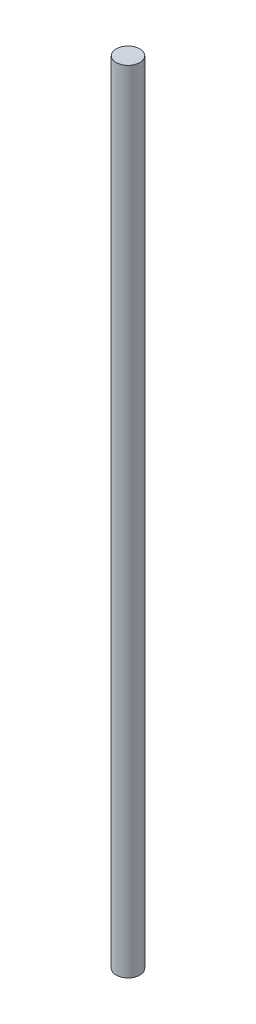
ISO-10303-21;
HEADER;
FILE_DESCRIPTION(('STEP AP214'),'2;1');
FILE_NAME('part.step','',(''),(''),'','','');
FILE_SCHEMA(('AUTOMOTIVE_DESIGN { 1 0 10303 214 1 1 1 1 }'));
ENDSEC;
DATA;
#1=APPLICATION_CONTEXT('core data for automotive mechanical design processes');
#2=APPLICATION_PROTOCOL_DEFINITION('international standard','automotive_design',2000,#1);
#3=PRODUCT_CONTEXT('',#1,'mechanical');
#4=PRODUCT('Part','Part','',(#3));
#5=PRODUCT_RELATED_PRODUCT_CATEGORY('part','',(#4));
#6=PRODUCT_DEFINITION_FORMATION('','',#4);
#7=PRODUCT_DEFINITION_CONTEXT('part definition',#1,'design');
#8=PRODUCT_DEFINITION('design','',#6,#7);
#9=PRODUCT_DEFINITION_SHAPE('','',#8);
#10=(LENGTH_UNIT() NAMED_UNIT(*) SI_UNIT(.MILLI.,.METRE.));
#11=(NAMED_UNIT(*) PLANE_ANGLE_UNIT() SI_UNIT($,.RADIAN.));
#12=(NAMED_UNIT(*) SI_UNIT($,.STERADIAN.) SOLID_ANGLE_UNIT());
#13=UNCERTAINTY_MEASURE_WITH_UNIT(LENGTH_MEASURE(1.E-05),#10,'distance_accuracy_value','');
#14=(GEOMETRIC_REPRESENTATION_CONTEXT(3) GLOBAL_UNCERTAINTY_ASSIGNED_CONTEXT((#13)) GLOBAL_UNIT_ASSIGNED_CONTEXT((#10,
#11,#12)) REPRESENTATION_CONTEXT('',''));
#15=CARTESIAN_POINT('',(0.,0.,0.));
#16=DIRECTION('',(0.,0.,1.));
#17=DIRECTION('',(1.,0.,0.));
#18=AXIS2_PLACEMENT_3D('',#15,#16,#17);
#19=CARTESIAN_POINT('',(0.,200.,0.));
#20=DIRECTION('',(0.,-1.,0.));
#21=DIRECTION('',(0.,0.,-1.));
#22=AXIS2_PLACEMENT_3D('',#19,#20,#21);
#23=CYLINDRICAL_SURFACE('',#22,3.);
#24=CARTESIAN_POINT('',(0.,200.,0.));
#25=DIRECTION('',(0.,1.,0.));
#26=DIRECTION('',(0.,0.,1.));
#27=AXIS2_PLACEMENT_3D('',#24,#25,#26);
#28=CIRCLE('',#27,3.);
#29=CARTESIAN_POINT('',(0.,200.,3.));
#30=VERTEX_POINT('',#29);
#31=EDGE_CURVE('E10',#30,#30,#28,.T.);
#32=ORIENTED_EDGE('',*,*,#31,.F.);
#33=EDGE_LOOP('',(#32));
#34=FACE_BOUND('',#33,.T.);
#35=CARTESIAN_POINT('',(0.,0.,0.));
#36=DIRECTION('',(0.,1.,0.));
#37=DIRECTION('',(0.,0.,1.));
#38=AXIS2_PLACEMENT_3D('',#35,#36,#37);
#39=CIRCLE('',#38,3.);
#40=CARTESIAN_POINT('',(0.,0.,3.));
#41=VERTEX_POINT('',#40);
#42=EDGE_CURVE('E35',#41,#41,#39,.T.);
#43=ORIENTED_EDGE('',*,*,#42,.T.);
#44=EDGE_LOOP('',(#43));
#45=FACE_BOUND('',#44,.T.);
#46=ADVANCED_FACE('F32',(#34,#45),#23,.T.);
#47=CARTESIAN_POINT('',(0.,200.,0.));
#48=DIRECTION('',(0.,1.,0.));
#49=DIRECTION('',(0.,0.,1.));
#50=AXIS2_PLACEMENT_3D('',#47,#48,#49);
#51=PLANE('',#50);
#52=ORIENTED_EDGE('',*,*,#31,.T.);
#53=EDGE_LOOP('',(#52));
#54=FACE_BOUND('',#53,.T.);
#55=ADVANCED_FACE('F47',(#54),#51,.T.);
#56=CARTESIAN_POINT('',(0.,0.,0.));
#57=DIRECTION('',(0.,1.,0.));
#58=DIRECTION('',(0.,0.,1.));
#59=AXIS2_PLACEMENT_3D('',#56,#57,#58);
#60=PLANE('',#59);
#61=ORIENTED_EDGE('',*,*,#42,.F.);
#62=EDGE_LOOP('',(#61));
#63=FACE_BOUND('',#62,.T.);
#64=ADVANCED_FACE('F45',(#63),#60,.F.);
#65=CLOSED_SHELL('',(#46,#55,#64));
#66=MANIFOLD_SOLID_BREP('B2',#65);
#67=ADVANCED_BREP_SHAPE_REPRESENTATION('',(#18,#66),#14);
#68=SHAPE_DEFINITION_REPRESENTATION(#9,#67);
ENDSEC;
END-ISO-10303-21;
